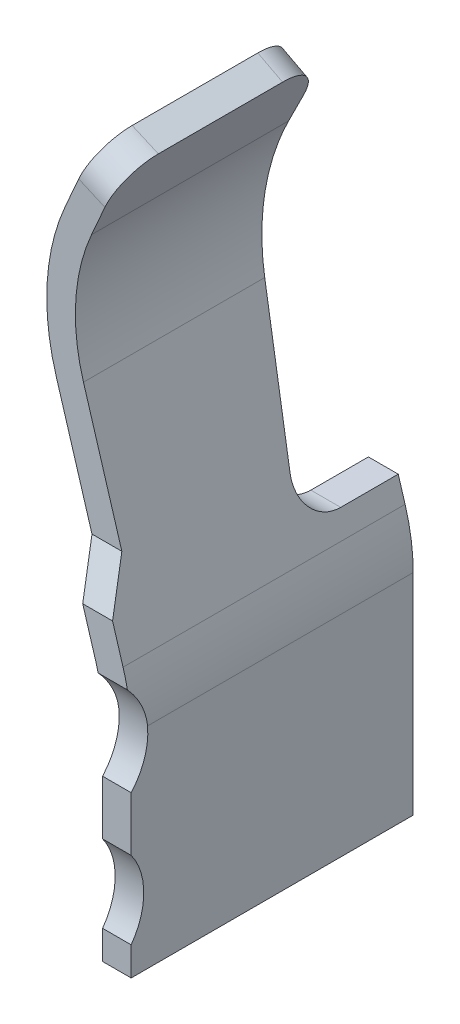
ISO-10303-21;
HEADER;
FILE_DESCRIPTION(('STEP AP214'),'2;1');
FILE_NAME('part.step','',(''),(''),'','','');
FILE_SCHEMA(('AUTOMOTIVE_DESIGN { 1 0 10303 214 1 1 1 1 }'));
ENDSEC;
DATA;
#1=APPLICATION_CONTEXT('core data for automotive mechanical design processes');
#2=APPLICATION_PROTOCOL_DEFINITION('international standard','automotive_design',2000,#1);
#3=PRODUCT_CONTEXT('',#1,'mechanical');
#4=PRODUCT('Part','Part','',(#3));
#5=PRODUCT_RELATED_PRODUCT_CATEGORY('part','',(#4));
#6=PRODUCT_DEFINITION_FORMATION('','',#4);
#7=PRODUCT_DEFINITION_CONTEXT('part definition',#1,'design');
#8=PRODUCT_DEFINITION('design','',#6,#7);
#9=PRODUCT_DEFINITION_SHAPE('','',#8);
#10=(LENGTH_UNIT() NAMED_UNIT(*) SI_UNIT(.MILLI.,.METRE.));
#11=(NAMED_UNIT(*) PLANE_ANGLE_UNIT() SI_UNIT($,.RADIAN.));
#12=(NAMED_UNIT(*) SI_UNIT($,.STERADIAN.) SOLID_ANGLE_UNIT());
#13=UNCERTAINTY_MEASURE_WITH_UNIT(LENGTH_MEASURE(1.E-05),#10,'distance_accuracy_value','');
#14=(GEOMETRIC_REPRESENTATION_CONTEXT(3) GLOBAL_UNCERTAINTY_ASSIGNED_CONTEXT((#13)) GLOBAL_UNIT_ASSIGNED_CONTEXT((#10,
#11,#12)) REPRESENTATION_CONTEXT('',''));
#15=CARTESIAN_POINT('',(0.,0.,0.));
#16=DIRECTION('',(0.,0.,1.));
#17=DIRECTION('',(1.,0.,0.));
#18=AXIS2_PLACEMENT_3D('',#15,#16,#17);
#19=CARTESIAN_POINT('',(-3.20155506681892,3.52330708865174,0.423604352914839));
#20=DIRECTION('',(0.915327071470027,-0.402711251685503,0.));
#21=DIRECTION('',(0.402711251685503,0.915327071470027,0.));
#22=AXIS2_PLACEMENT_3D('',#19,#20,#21);
#23=CYLINDRICAL_SURFACE('',#22,0.2);
#24=CARTESIAN_POINT('',(-3.20155506681891,3.52330708865174,0.423604352914839));
#25=DIRECTION('',(-0.915327071470028,0.4027112516855,0.));
#26=DIRECTION('',(0.4027112516855,0.915327071470028,0.));
#27=AXIS2_PLACEMENT_3D('',#24,#25,#26);
#28=CIRCLE('',#27,0.2);
#29=CARTESIAN_POINT('',(-3.20155506681891,3.52330708865174,0.623604352914839));
#30=VERTEX_POINT('',#29);
#31=CARTESIAN_POINT('',(-3.12101281648181,3.70637250294574,0.423604352914839));
#32=VERTEX_POINT('',#31);
#33=EDGE_CURVE('E471',#30,#32,#28,.T.);
#34=ORIENTED_EDGE('',*,*,#33,.F.);
#35=DIRECTION('',(-0.915327071470027,0.402711251685503,0.));
#36=VECTOR('',#35,1.);
#37=CARTESIAN_POINT('',(-27.8115059297134,14.3508073613119,0.623604352914805));
#38=LINE('',#37,#36);
#39=CARTESIAN_POINT('',(-3.06425600609841,3.46290040089891,0.623604352914839));
#40=VERTEX_POINT('',#39);
#41=EDGE_CURVE('E27',#40,#30,#38,.T.);
#42=ORIENTED_EDGE('',*,*,#41,.F.);
#43=CARTESIAN_POINT('',(-3.06425600609841,3.46290040089891,0.423604352914839));
#44=DIRECTION('',(0.915327071470027,-0.402711251685502,0.));
#45=DIRECTION('',(-0.402711251685502,-0.915327071470027,0.));
#46=AXIS2_PLACEMENT_3D('',#43,#44,#45);
#47=CIRCLE('',#46,0.2);
#48=CARTESIAN_POINT('',(-2.98371375576131,3.64596581519291,0.423604352914839));
#49=VERTEX_POINT('',#48);
#50=EDGE_CURVE('E567',#49,#40,#47,.T.);
#51=ORIENTED_EDGE('',*,*,#50,.F.);
#52=DIRECTION('',(0.915327071470027,-0.402711251685503,0.));
#53=VECTOR('',#52,1.);
#54=CARTESIAN_POINT('',(-3.12101281648181,3.70637250294574,0.423604352914839));
#55=LINE('',#54,#53);
#56=EDGE_CURVE('E445',#32,#49,#55,.T.);
#57=ORIENTED_EDGE('',*,*,#56,.F.);
#58=EDGE_LOOP('',(#34,#42,#51,#57));
#59=FACE_BOUND('',#58,.T.);
#60=ADVANCED_FACE('F16',(#59),#23,.T.);
#61=CARTESIAN_POINT('',(-3.22386274132999,3.53312166947706,-0.236832722369337));
#62=DIRECTION('',(-0.914255270392898,0.402239697454473,-0.0483789866630451));
#63=DIRECTION('',(-0.402711251685503,-0.915327071470027,0.));
#64=AXIS2_PLACEMENT_3D('',#61,#62,#63);
#65=CYLINDRICAL_SURFACE('',#64,0.2);
#66=CARTESIAN_POINT('',(-3.07305946195422,3.44289092405021,-0.427421697659668));
#67=CARTESIAN_POINT('',(-3.02198253480763,3.55898426375477,-0.441384710680955));
#68=CARTESIAN_POINT('',(-2.98371375576131,3.64596581519291,-0.356133634256613));
#69=CARTESIAN_POINT('',(-2.98371375576131,3.64596581519291,-0.228386927890316));
#70=(BOUNDED_CURVE() B_SPLINE_CURVE(3,(#66,#67,#68,#69),.UNSPECIFIED.,.F.,
.F.) B_SPLINE_CURVE_WITH_KNOTS((4,4),(6.17366415670651,7.85398163397443),
.UNSPECIFIED.) CURVE() GEOMETRIC_REPRESENTATION_ITEM() RATIONAL_B_SPLINE_CURVE((1.,
0.77822974253387,0.77822974253387,1.)) REPRESENTATION_ITEM(''));
#71=CARTESIAN_POINT('',(-3.07305946195422,3.44289092405021,-0.427421697659668));
#72=VERTEX_POINT('',#71);
#73=CARTESIAN_POINT('',(-2.98371375576131,3.64596581519291,-0.228386927890316));
#74=VERTEX_POINT('',#73);
#75=EDGE_CURVE('E571',#72,#74,#70,.T.);
#76=ORIENTED_EDGE('',*,*,#75,.F.);
#77=DIRECTION('',(0.914255270392898,-0.402239697454473,0.0483789866630451));
#78=VECTOR('',#77,1.);
#79=CARTESIAN_POINT('',(-28.411852655037,14.5910558161891,-1.76825633941021));
#80=LINE('',#79,#78);
#81=CARTESIAN_POINT('',(-3.21035852267473,3.50329761180303,-0.434687053017796));
#82=VERTEX_POINT('',#81);
#83=EDGE_CURVE('E11',#82,#72,#80,.T.);
#84=ORIENTED_EDGE('',*,*,#83,.F.);
#85=CARTESIAN_POINT('',(-3.12101281648181,3.70637250294574,-0.235652283248443));
#86=CARTESIAN_POINT('',(-3.12101281648182,3.70637250294574,-0.363398989614741));
#87=CARTESIAN_POINT('',(-3.15928159552814,3.6193909515076,-0.448650066039083));
#88=CARTESIAN_POINT('',(-3.21035852267473,3.50329761180303,-0.434687053017796));
#89=(BOUNDED_CURVE() B_SPLINE_CURVE(3,(#85,#86,#87,#88),.UNSPECIFIED.,.F.,
.F.) B_SPLINE_CURVE_WITH_KNOTS((4,4),(4.71238898038476,6.39270645765268),
.UNSPECIFIED.) CURVE() GEOMETRIC_REPRESENTATION_ITEM() RATIONAL_B_SPLINE_CURVE((1.,
0.77822974253387,0.77822974253387,1.)) REPRESENTATION_ITEM(''));
#90=CARTESIAN_POINT('',(-3.12101281648181,3.70637250294574,-0.235652283248443));
#91=VERTEX_POINT('',#90);
#92=EDGE_CURVE('E462',#91,#82,#89,.T.);
#93=ORIENTED_EDGE('',*,*,#92,.F.);
#94=DIRECTION('',(-0.914255270392898,0.402239697454473,-0.0483789866630451));
#95=VECTOR('',#94,1.);
#96=CARTESIAN_POINT('',(-3.14332049099289,3.71618708377106,-0.236832722369337));
#97=LINE('',#96,#95);
#98=EDGE_CURVE('E449',#74,#91,#97,.T.);
#99=ORIENTED_EDGE('',*,*,#98,.F.);
#100=EDGE_LOOP('',(#76,#84,#93,#99));
#101=FACE_BOUND('',#100,.T.);
#102=ADVANCED_FACE('F854',(#101),#65,.T.);
#103=CARTESIAN_POINT('',(-33.27,1.65634067151207,-0.212546111318104));
#104=DIRECTION('',(0.,-1.,0.));
#105=DIRECTION('',(0.,0.,-1.));
#106=AXIS2_PLACEMENT_3D('',#103,#104,#105);
#107=PLANE('',#106);
#108=DIRECTION('',(0.,0.,-1.));
#109=VECTOR('',#108,1.);
#110=CARTESIAN_POINT('',(-3.04516492105846,1.65634067151207,-0.740000000000018));
#111=LINE('',#110,#109);
#112=CARTESIAN_POINT('',(-3.04516492105846,1.65634067151207,-0.438042305987952));
#113=VERTEX_POINT('',#112);
#114=CARTESIAN_POINT('',(-3.04516492105846,1.65634067151207,-0.740000000000018));
#115=VERTEX_POINT('',#114);
#116=EDGE_CURVE('E269',#113,#115,#111,.T.);
#117=ORIENTED_EDGE('',*,*,#116,.F.);
#118=DIRECTION('',(1.,0.,0.));
#119=VECTOR('',#118,1.);
#120=CARTESIAN_POINT('',(-2.88849659089444,1.65634067151207,-0.438042305987951));
#121=LINE('',#120,#119);
#122=CARTESIAN_POINT('',(-2.88849659089442,1.65634067151207,-0.438042305987951));
#123=VERTEX_POINT('',#122);
#124=EDGE_CURVE('E231',#113,#123,#121,.T.);
#125=ORIENTED_EDGE('',*,*,#124,.T.);
#126=DIRECTION('',(0.,0.,1.));
#127=VECTOR('',#126,1.);
#128=CARTESIAN_POINT('',(-2.88849659089442,1.65634067151207,-0.740000000000018));
#129=LINE('',#128,#127);
#130=CARTESIAN_POINT('',(-2.88849659089442,1.65634067151207,-0.740000000000018));
#131=VERTEX_POINT('',#130);
#132=EDGE_CURVE('E228',#131,#123,#129,.T.);
#133=ORIENTED_EDGE('',*,*,#132,.F.);
#134=DIRECTION('',(-1.,0.,0.));
#135=VECTOR('',#134,1.);
#136=CARTESIAN_POINT('',(-3.81,1.65634067151207,-0.740000000000019));
#137=LINE('',#136,#135);
#138=EDGE_CURVE('E213',#131,#115,#137,.T.);
#139=ORIENTED_EDGE('',*,*,#138,.T.);
#140=EDGE_LOOP('',(#117,#125,#133,#139));
#141=FACE_BOUND('',#140,.T.);
#142=ADVANCED_FACE('F229',(#141),#107,.F.);
#143=CARTESIAN_POINT('',(-33.27,3.70637250294571,-0.459111687165995));
#144=DIRECTION('',(0.,0.119413416546905,0.992844618230162));
#145=DIRECTION('',(1.,0.,0.));
#146=AXIS2_PLACEMENT_3D('',#143,#144,#145);
#147=PLANE('',#146);
#148=DIRECTION('',(-0.28674853992682,0.951150986717314,-0.11439875574724));
#149=VECTOR('',#148,1.);
#150=CARTESIAN_POINT('',(-2.87033604511149,1.59610175610151,-0.205300934614502));
#151=LINE('',#150,#149);
#152=CARTESIAN_POINT('',(-2.95599169256637,1.88022335482146,-0.239473382341919));
#153=VERTEX_POINT('',#152);
#154=CARTESIAN_POINT('',(-3.17658626409634,2.61194022573825,-0.327479914176621));
#155=VERTEX_POINT('',#154);
#156=EDGE_CURVE('E235',#153,#155,#151,.T.);
#157=ORIENTED_EDGE('',*,*,#156,.F.);
#158=DIRECTION('',(-1.,0.,0.));
#159=VECTOR('',#158,1.);
#160=CARTESIAN_POINT('',(-3.04516492105847,1.88022335482146,-0.23947338234192));
#161=LINE('',#160,#159);
#162=CARTESIAN_POINT('',(-3.11266002273041,1.88022335482146,-0.23947338234192));
#163=VERTEX_POINT('',#162);
#164=EDGE_CURVE('E379',#153,#163,#161,.T.);
#165=ORIENTED_EDGE('',*,*,#164,.T.);
#166=DIRECTION('',(0.286748539926818,-0.951150986717315,0.11439875574724));
#167=VECTOR('',#166,1.);
#168=CARTESIAN_POINT('',(-3.01412236488806,1.55337185451571,-0.200161637444145));
#169=LINE('',#168,#167);
#170=CARTESIAN_POINT('',(-3.32020176045379,2.56864369924933,-0.322272466749579));
#171=VERTEX_POINT('',#170);
#172=EDGE_CURVE('E545',#171,#163,#169,.T.);
#173=ORIENTED_EDGE('',*,*,#172,.F.);
#174=CARTESIAN_POINT('',(-3.27177575390392,3.36370167510267,-0.417897288102545));
#175=CARTESIAN_POINT('',(-3.38330079490673,3.11021511680704,-0.387409439934768));
#176=CARTESIAN_POINT('',(-3.40013739459604,2.83379189253285,-0.354162906673266));
#177=CARTESIAN_POINT('',(-3.32020176045379,2.56864369924933,-0.322272466749579));
#178=(BOUNDED_CURVE() B_SPLINE_CURVE(3,(#174,#175,#176,#177),.UNSPECIFIED.,.F.,
.F.) B_SPLINE_CURVE_WITH_KNOTS((4,4),(4.29791199977039,5.00519872138853),
.UNSPECIFIED.) CURVE() GEOMETRIC_REPRESENTATION_ITEM() RATIONAL_B_SPLINE_CURVE((1.,
0.958744787021091,0.958744787021091,1.)) REPRESENTATION_ITEM(''));
#179=CARTESIAN_POINT('',(-3.27177575390392,3.36370167510267,-0.417897288102545));
#180=VERTEX_POINT('',#179);
#181=EDGE_CURVE('E550',#180,#171,#178,.T.);
#182=ORIENTED_EDGE('',*,*,#181,.F.);
#183=DIRECTION('',(-0.400292818236851,-0.909830186054405,0.109428936813832));
#184=VECTOR('',#183,1.);
#185=CARTESIAN_POINT('',(-3.25766648991178,3.39577078475993,-0.421754368938234));
#186=LINE('',#185,#184);
#187=EDGE_CURVE('E459',#82,#180,#186,.T.);
#188=ORIENTED_EDGE('',*,*,#187,.F.);
#189=ORIENTED_EDGE('',*,*,#83,.T.);
#190=DIRECTION('',(0.400292818236852,0.909830186054405,-0.109428936813832));
#191=VECTOR('',#190,1.);
#192=CARTESIAN_POINT('',(-3.12004918034407,3.33608744850051,-0.414576013974332));
#193=LINE('',#192,#191);
#194=CARTESIAN_POINT('',(-3.13447669318341,3.30329498734983,-0.410631932744417));
#195=VERTEX_POINT('',#194);
#196=EDGE_CURVE('E437',#195,#72,#193,.T.);
#197=ORIENTED_EDGE('',*,*,#196,.F.);
#198=CARTESIAN_POINT('',(-3.17658626409634,2.61194022573825,-0.327479914176621));
#199=CARTESIAN_POINT('',(-3.24609551117657,2.84250387207174,-0.355210731501565));
#200=CARTESIAN_POINT('',(-3.2314549897076,3.08287189317973,-0.384120760424611));
#201=CARTESIAN_POINT('',(-3.13447669318341,3.30329498734983,-0.410631932744417));
#202=(BOUNDED_CURVE() B_SPLINE_CURVE(3,(#198,#199,#200,#201),.UNSPECIFIED.,.F.,
.F.) B_SPLINE_CURVE_WITH_KNOTS((4,4),(1.27798658579106,1.98527330740919),
.UNSPECIFIED.) CURVE() GEOMETRIC_REPRESENTATION_ITEM() RATIONAL_B_SPLINE_CURVE((1.,
0.958744787021091,0.958744787021091,1.)) REPRESENTATION_ITEM(''));
#203=EDGE_CURVE('E251',#155,#195,#202,.T.);
#204=ORIENTED_EDGE('',*,*,#203,.F.);
#205=EDGE_LOOP('',(#157,#165,#173,#182,#188,#189,#197,#204));
#206=FACE_BOUND('',#205,.T.);
#207=ADVANCED_FACE('F301',(#206),#147,.F.);
#208=CARTESIAN_POINT('',(-33.27,1.94413292378283,0.623604352914797));
#209=DIRECTION('',(0.,0.,-1.));
#210=DIRECTION('',(0.,-1.,0.));
#211=AXIS2_PLACEMENT_3D('',#208,#209,#210);
#212=PLANE('',#211);
#213=DIRECTION('',(-0.402711251685501,-0.915327071470028,0.));
#214=VECTOR('',#213,1.);
#215=CARTESIAN_POINT('',(-3.13447669318342,3.30329498734984,0.623604352914839));
#216=LINE('',#215,#214);
#217=CARTESIAN_POINT('',(-3.13447669318341,3.30329498734984,0.623604352914839));
#218=VERTEX_POINT('',#217);
#219=EDGE_CURVE('E467',#40,#218,#216,.T.);
#220=ORIENTED_EDGE('',*,*,#219,.F.);
#221=ORIENTED_EDGE('',*,*,#41,.T.);
#222=DIRECTION('',(0.4027112516855,0.915327071470028,0.));
#223=VECTOR('',#222,1.);
#224=CARTESIAN_POINT('',(-3.27177575390392,3.36370167510267,0.623604352914839));
#225=LINE('',#224,#223);
#226=CARTESIAN_POINT('',(-3.27177575390392,3.36370167510267,0.623604352914839));
#227=VERTEX_POINT('',#226);
#228=EDGE_CURVE('E461',#227,#30,#225,.T.);
#229=ORIENTED_EDGE('',*,*,#228,.F.);
#230=CARTESIAN_POINT('',(-2.21914962171339,2.90058373566433,0.62360435291484));
#231=DIRECTION('',(0.,0.,-1.));
#232=DIRECTION('',(-1.,0.,0.));
#233=AXIS2_PLACEMENT_3D('',#230,#231,#232);
#234=CIRCLE('',#233,1.15);
#235=CARTESIAN_POINT('',(-3.32020176045379,2.56864369924933,0.623604352914839));
#236=VERTEX_POINT('',#235);
#237=EDGE_CURVE('E597',#236,#227,#234,.T.);
#238=ORIENTED_EDGE('',*,*,#237,.F.);
#239=DIRECTION('',(-0.288643509926088,0.957436642382956,0.));
#240=VECTOR('',#239,1.);
#241=CARTESIAN_POINT('',(-2.99617885397449,1.49385284836845,0.623604352914839));
#242=LINE('',#241,#240);
#243=CARTESIAN_POINT('',(-3.13192717993568,1.94413292378283,0.623604352914839));
#244=VERTEX_POINT('',#243);
#245=EDGE_CURVE('E454',#244,#236,#242,.T.);
#246=ORIENTED_EDGE('',*,*,#245,.F.);
#247=DIRECTION('',(1.,0.,0.));
#248=VECTOR('',#247,1.);
#249=CARTESIAN_POINT('',(-33.27,1.94413292378283,0.623604352914797));
#250=LINE('',#249,#248);
#251=CARTESIAN_POINT('',(-2.97525884977164,1.94413292378283,0.623604352914839));
#252=VERTEX_POINT('',#251);
#253=EDGE_CURVE('E225',#244,#252,#250,.T.);
#254=ORIENTED_EDGE('',*,*,#253,.T.);
#255=DIRECTION('',(0.28864350992609,-0.957436642382956,0.));
#256=VECTOR('',#255,1.);
#257=CARTESIAN_POINT('',(-2.85256335761705,1.53714937485737,0.623604352914839));
#258=LINE('',#257,#256);
#259=CARTESIAN_POINT('',(-3.17658626409635,2.61194022573825,0.623604352914839));
#260=VERTEX_POINT('',#259);
#261=EDGE_CURVE('E433',#260,#252,#258,.T.);
#262=ORIENTED_EDGE('',*,*,#261,.F.);
#263=CARTESIAN_POINT('',(-2.21914962171339,2.90058373566433,0.62360435291484));
#264=DIRECTION('',(0.,0.,1.));
#265=DIRECTION('',(-1.,0.,0.));
#266=AXIS2_PLACEMENT_3D('',#263,#264,#265);
#267=CIRCLE('',#266,1.);
#268=EDGE_CURVE('E243',#218,#260,#267,.T.);
#269=ORIENTED_EDGE('',*,*,#268,.F.);
#270=EDGE_LOOP('',(#220,#221,#229,#238,#246,#254,#262,#269));
#271=FACE_BOUND('',#270,.T.);
#272=ADVANCED_FACE('F304',(#271),#212,.F.);
#273=CARTESIAN_POINT('',(-33.27,1.7003498353216,0.749999999999972));
#274=DIRECTION('',(0.,-0.460287319631494,-0.887770005906065));
#275=DIRECTION('',(0.,-0.887770005906065,0.460287319631494));
#276=AXIS2_PLACEMENT_3D('',#273,#274,#275);
#277=PLANE('',#276);
#278=DIRECTION('',(-1.,0.,0.));
#279=VECTOR('',#278,1.);
#280=CARTESIAN_POINT('',(-3.81,1.7196371362757,0.739999999999981));
#281=LINE('',#280,#279);
#282=CARTESIAN_POINT('',(-2.90757891232074,1.7196371362757,0.739999999999982));
#283=VERTEX_POINT('',#282);
#284=CARTESIAN_POINT('',(-3.06424724248478,1.7196371362757,0.739999999999982));
#285=VERTEX_POINT('',#284);
#286=EDGE_CURVE('E472',#283,#285,#281,.T.);
#287=ORIENTED_EDGE('',*,*,#286,.F.);
#288=DIRECTION('',(0.258541028225372,-0.857586072334425,0.444637678635293));
#289=VECTOR('',#288,1.);
#290=CARTESIAN_POINT('',(-3.03357656169357,2.13757401070795,0.523309818502748));
#291=LINE('',#290,#289);
#292=EDGE_CURVE('E426',#252,#283,#291,.T.);
#293=ORIENTED_EDGE('',*,*,#292,.F.);
#294=ORIENTED_EDGE('',*,*,#253,.F.);
#295=DIRECTION('',(-0.258541028225371,0.857586072334425,-0.444637678635293));
#296=VECTOR('',#295,1.);
#297=CARTESIAN_POINT('',(-3.1797726380838,2.10283732290249,0.541319952677684));
#298=LINE('',#297,#296);
#299=EDGE_CURVE('E268',#285,#244,#298,.T.);
#300=ORIENTED_EDGE('',*,*,#299,.F.);
#301=EDGE_LOOP('',(#287,#293,#294,#300));
#302=FACE_BOUND('',#301,.T.);
#303=ADVANCED_FACE('F308',(#302),#277,.F.);
#304=CARTESIAN_POINT('',(-3.81,1.24850586493128,0.739999999999981));
#305=DIRECTION('',(0.,0.,-1.));
#306=DIRECTION('',(0.,-1.,0.));
#307=AXIS2_PLACEMENT_3D('',#304,#305,#306);
#308=PLANE('',#307);
#309=DIRECTION('',(0.,-1.,0.));
#310=VECTOR('',#309,1.);
#311=CARTESIAN_POINT('',(-2.81,0.145965815192914,0.739999999999982));
#312=LINE('',#311,#310);
#313=CARTESIAN_POINT('',(-2.81,0.296740599868486,0.739999999999982));
#314=VERTEX_POINT('',#313);
#315=CARTESIAN_POINT('',(-2.81,0.145965815192914,0.739999999999982));
#316=VERTEX_POINT('',#315);
#317=EDGE_CURVE('E270',#314,#316,#312,.T.);
#318=ORIENTED_EDGE('',*,*,#317,.F.);
#319=DIRECTION('',(-1.,0.,0.));
#320=VECTOR('',#319,1.);
#321=CARTESIAN_POINT('',(-33.27,0.296740599868486,0.73999999999994));
#322=LINE('',#321,#320);
#323=CARTESIAN_POINT('',(-2.96,0.296740599868486,0.739999999999982));
#324=VERTEX_POINT('',#323);
#325=EDGE_CURVE('E440',#314,#324,#322,.T.);
#326=ORIENTED_EDGE('',*,*,#325,.T.);
#327=DIRECTION('',(0.,1.,0.));
#328=VECTOR('',#327,1.);
#329=CARTESIAN_POINT('',(-2.96,0.145965815192914,0.739999999999982));
#330=LINE('',#329,#328);
#331=CARTESIAN_POINT('',(-2.96,0.145965815192914,0.739999999999982));
#332=VERTEX_POINT('',#331);
#333=EDGE_CURVE('E255',#332,#324,#330,.T.);
#334=ORIENTED_EDGE('',*,*,#333,.F.);
#335=DIRECTION('',(-1.,0.,0.));
#336=VECTOR('',#335,1.);
#337=CARTESIAN_POINT('',(-2.96,0.145965815192914,0.739999999999982));
#338=LINE('',#337,#336);
#339=EDGE_CURVE('E532',#316,#332,#338,.T.);
#340=ORIENTED_EDGE('',*,*,#339,.F.);
#341=EDGE_LOOP('',(#318,#326,#334,#340));
#342=FACE_BOUND('',#341,.T.);
#343=ADVANCED_FACE('F950',(#342),#308,.F.);
#344=CARTESIAN_POINT('',(-3.81,1.24850586493128,-0.740000000000019));
#345=DIRECTION('',(0.,0.,-1.));
#346=DIRECTION('',(0.,-1.,0.));
#347=AXIS2_PLACEMENT_3D('',#344,#345,#346);
#348=PLANE('',#347);
#349=ORIENTED_EDGE('',*,*,#138,.F.);
#350=DIRECTION('',(0.28864350992609,-0.957436642382956,0.));
#351=VECTOR('',#350,1.);
#352=CARTESIAN_POINT('',(-2.85256335761705,1.53714937485737,-0.740000000000018));
#353=LINE('',#352,#351);
#354=CARTESIAN_POINT('',(-2.85256335761705,1.53714937485737,-0.740000000000018));
#355=VERTEX_POINT('',#354);
#356=EDGE_CURVE('E217',#131,#355,#353,.T.);
#357=ORIENTED_EDGE('',*,*,#356,.T.);
#358=CARTESIAN_POINT('',(-3.81,1.24850586493128,-0.740000000000019));
#359=DIRECTION('',(0.,0.,-1.));
#360=DIRECTION('',(-1.,0.,0.));
#361=AXIS2_PLACEMENT_3D('',#358,#359,#360);
#362=CIRCLE('',#361,1.);
#363=CARTESIAN_POINT('',(-2.81,1.24850586493128,-0.740000000000018));
#364=VERTEX_POINT('',#363);
#365=EDGE_CURVE('E273',#355,#364,#362,.T.);
#366=ORIENTED_EDGE('',*,*,#365,.T.);
#367=DIRECTION('',(0.,-1.,0.));
#368=VECTOR('',#367,1.);
#369=CARTESIAN_POINT('',(-2.81,0.145965815192914,-0.740000000000018));
#370=LINE('',#369,#368);
#371=CARTESIAN_POINT('',(-2.81,0.145965815192914,-0.740000000000018));
#372=VERTEX_POINT('',#371);
#373=EDGE_CURVE('E42',#364,#372,#370,.T.);
#374=ORIENTED_EDGE('',*,*,#373,.T.);
#375=DIRECTION('',(-1.,0.,0.));
#376=VECTOR('',#375,1.);
#377=CARTESIAN_POINT('',(-2.96,0.145965815192914,-0.740000000000018));
#378=LINE('',#377,#376);
#379=CARTESIAN_POINT('',(-2.96,0.145965815192914,-0.740000000000018));
#380=VERTEX_POINT('',#379);
#381=EDGE_CURVE('E453',#372,#380,#378,.T.);
#382=ORIENTED_EDGE('',*,*,#381,.T.);
#383=DIRECTION('',(0.,1.,0.));
#384=VECTOR('',#383,1.);
#385=CARTESIAN_POINT('',(-2.96,0.145965815192914,-0.740000000000018));
#386=LINE('',#385,#384);
#387=CARTESIAN_POINT('',(-2.96,1.24850586493128,-0.740000000000018));
#388=VERTEX_POINT('',#387);
#389=EDGE_CURVE('E370',#380,#388,#386,.T.);
#390=ORIENTED_EDGE('',*,*,#389,.T.);
#391=CARTESIAN_POINT('',(-3.81,1.24850586493128,-0.740000000000019));
#392=DIRECTION('',(0.,0.,1.));
#393=DIRECTION('',(-1.,0.,0.));
#394=AXIS2_PLACEMENT_3D('',#391,#392,#393);
#395=CIRCLE('',#394,0.85);
#396=CARTESIAN_POINT('',(-2.99617885397448,1.49385284836845,-0.740000000000018));
#397=VERTEX_POINT('',#396);
#398=EDGE_CURVE('E574',#388,#397,#395,.T.);
#399=ORIENTED_EDGE('',*,*,#398,.T.);
#400=DIRECTION('',(-0.288643509926088,0.957436642382956,0.));
#401=VECTOR('',#400,1.);
#402=CARTESIAN_POINT('',(-2.99617885397448,1.49385284836845,-0.740000000000018));
#403=LINE('',#402,#401);
#404=EDGE_CURVE('E220',#397,#115,#403,.T.);
#405=ORIENTED_EDGE('',*,*,#404,.T.);
#406=EDGE_LOOP('',(#349,#357,#366,#374,#382,#390,#399,#405));
#407=FACE_BOUND('',#406,.T.);
#408=ADVANCED_FACE('F215',(#407),#348,.T.);
#409=CARTESIAN_POINT('',(-2.81,0.145965815192914,-0.740000000000018));
#410=DIRECTION('',(-1.,0.,0.));
#411=DIRECTION('',(0.,0.,1.));
#412=AXIS2_PLACEMENT_3D('',#409,#410,#411);
#413=PLANE('',#412);
#414=DIRECTION('',(0.,0.,1.));
#415=VECTOR('',#414,1.);
#416=CARTESIAN_POINT('',(-2.81,1.24850586493128,-0.740000000000018));
#417=LINE('',#416,#415);
#418=CARTESIAN_POINT('',(-2.81,1.24850586493128,0.654029100989327));
#419=VERTEX_POINT('',#418);
#420=EDGE_CURVE('E416',#364,#419,#417,.T.);
#421=ORIENTED_EDGE('',*,*,#420,.T.);
#422=CARTESIAN_POINT('',(-2.81,1.21669179396546,0.995153761033099));
#423=DIRECTION('',(1.,0.,0.));
#424=DIRECTION('',(0.,0.,1.));
#425=AXIS2_PLACEMENT_3D('',#422,#423,#424);
#426=CIRCLE('',#425,0.342604974863759);
#427=CARTESIAN_POINT('',(-2.81,0.988055123608201,0.739999999999982));
#428=VERTEX_POINT('',#427);
#429=EDGE_CURVE('E400',#428,#419,#426,.T.);
#430=ORIENTED_EDGE('',*,*,#429,.F.);
#431=DIRECTION('',(0.,-1.,0.));
#432=VECTOR('',#431,1.);
#433=CARTESIAN_POINT('',(-2.81,0.145965815192914,0.739999999999982));
#434=LINE('',#433,#432);
#435=CARTESIAN_POINT('',(-2.81,0.703259400131467,0.739999999999982));
#436=VERTEX_POINT('',#435);
#437=EDGE_CURVE('E587',#428,#436,#434,.T.);
#438=ORIENTED_EDGE('',*,*,#437,.T.);
#439=CARTESIAN_POINT('',(-2.81,0.499999999999977,1.01942683457021));
#440=DIRECTION('',(1.,0.,0.));
#441=DIRECTION('',(0.,0.,1.));
#442=AXIS2_PLACEMENT_3D('',#439,#440,#441);
#443=CIRCLE('',#442,0.345533991988848);
#444=EDGE_CURVE('E444',#314,#436,#443,.T.);
#445=ORIENTED_EDGE('',*,*,#444,.F.);
#446=ORIENTED_EDGE('',*,*,#317,.T.);
#447=DIRECTION('',(0.,0.,1.));
#448=VECTOR('',#447,1.);
#449=CARTESIAN_POINT('',(-2.81,0.145965815192914,-0.740000000000018));
#450=LINE('',#449,#448);
#451=EDGE_CURVE('E371',#372,#316,#450,.T.);
#452=ORIENTED_EDGE('',*,*,#451,.F.);
#453=ORIENTED_EDGE('',*,*,#373,.F.);
#454=EDGE_LOOP('',(#421,#430,#438,#445,#446,#452,#453));
#455=FACE_BOUND('',#454,.T.);
#456=ADVANCED_FACE('F319',(#455),#413,.F.);
#457=CARTESIAN_POINT('',(-3.81,1.24850586493128,-0.740000000000019));
#458=DIRECTION('',(0.,0.,1.));
#459=DIRECTION('',(1.,0.,0.));
#460=AXIS2_PLACEMENT_3D('',#457,#458,#459);
#461=CYLINDRICAL_SURFACE('',#460,1.);
#462=CARTESIAN_POINT('',(-3.81,1.24850586493128,0.739999999999981));
#463=DIRECTION('',(0.,0.,-1.));
#464=DIRECTION('',(-1.,0.,0.));
#465=AXIS2_PLACEMENT_3D('',#462,#463,#464);
#466=CIRCLE('',#465,1.);
#467=CARTESIAN_POINT('',(-2.85256335761705,1.53714937485737,0.739999999999982));
#468=VERTEX_POINT('',#467);
#469=CARTESIAN_POINT('',(-2.82956088186527,1.44532846432271,0.739999999999982));
#470=VERTEX_POINT('',#469);
#471=EDGE_CURVE('E343',#468,#470,#466,.T.);
#472=ORIENTED_EDGE('',*,*,#471,.T.);
#473=CARTESIAN_POINT('',(-2.82956088186528,1.44532846432271,0.739999999999982));
#474=CARTESIAN_POINT('',(-2.82887868258316,1.44193024717417,0.736954698545497));
#475=CARTESIAN_POINT('',(-2.82820278149149,1.43847176034264,0.733975045899673));
#476=CARTESIAN_POINT('',(-2.826871440474,1.43145643098159,0.728168909339876));
#477=CARTESIAN_POINT('',(-2.82621591068375,1.42790021102154,0.725341693611786));
#478=CARTESIAN_POINT('',(-2.82492831183025,1.42068928784943,0.719840380711082));
#479=CARTESIAN_POINT('',(-2.82429616172075,1.41703501951577,0.71716573280542));
#480=CARTESIAN_POINT('',(-2.8230584278734,1.40962817005605,0.711969336935208));
#481=CARTESIAN_POINT('',(-2.82245278447869,1.40587584366106,0.709447240161664));
#482=CARTESIAN_POINT('',(-2.82127122870312,1.39827302810691,0.704555749407203));
#483=CARTESIAN_POINT('',(-2.82069529111151,1.3944226264712,0.702186225501798));
#484=CARTESIAN_POINT('',(-2.819576382774,1.38662388081493,0.697599649617223));
#485=CARTESIAN_POINT('',(-2.8190334341832,1.38267547342748,0.695382699975703));
#486=CARTESIAN_POINT('',(-2.81798380395004,1.37468096295891,0.691101059928101));
#487=CARTESIAN_POINT('',(-2.81747720426113,1.37063466501766,0.689036713287234));
#488=CARTESIAN_POINT('',(-2.81650364840602,1.36244473872734,0.685059955148872));
#489=CARTESIAN_POINT('',(-2.81603684560395,1.35830080604148,0.683148133100298));
#490=CARTESIAN_POINT('',(-2.81514614898274,1.34991442649087,0.679475891500459));
#491=CARTESIAN_POINT('',(-2.81472250492899,1.34567156354324,0.677716361222166));
#492=CARTESIAN_POINT('',(-2.81392647194206,1.33713872195216,0.674376033868776));
#493=CARTESIAN_POINT('',(-2.81355381064897,1.33284913740271,0.672794295796527));
#494=CARTESIAN_POINT('',(-2.81286136145208,1.32422362544486,0.669809238507249));
#495=CARTESIAN_POINT('',(-2.81254136585005,1.31988795555424,0.668405223722618));
#496=CARTESIAN_POINT('',(-2.81195585588988,1.3111710125325,0.665775382478355));
#497=CARTESIAN_POINT('',(-2.81169020857531,1.30678987892384,0.664549123358638));
#498=CARTESIAN_POINT('',(-2.81121500632154,1.29798278695399,0.662274523841769));
#499=CARTESIAN_POINT('',(-2.81100540203927,1.29355687160846,0.661226027233375));
#500=CARTESIAN_POINT('',(-2.81064388775924,1.28466100981375,0.659306657193404));
#501=CARTESIAN_POINT('',(-2.81049201945118,1.28019103392983,0.65843591232121));
#502=CARTESIAN_POINT('',(-2.81024760848128,1.27120787033427,0.656871822149784));
#503=CARTESIAN_POINT('',(-2.81015520429872,1.26669460642052,0.65617889318396));
#504=CARTESIAN_POINT('',(-2.81003124362393,1.25762568522579,0.654969909316688));
#505=CARTESIAN_POINT('',(-2.80999992587799,1.25306993125335,0.654454554866671));
#506=CARTESIAN_POINT('',(-2.81,1.24850586493128,0.654029100989326));
#507=B_SPLINE_CURVE_WITH_KNOTS('',3,(#473,#474,#475,#476,#477,#478,#479,#480,#481,#482,#483,
#484,#485,#486,#487,#488,#489,#490,#491,#492,#493,#494,#495,#496,#497,#498,#499,#500,#501,#502,
#503,#504,#505,#506),.UNSPECIFIED.,.F.,.F.,(4,2,2,2,2,2,2,2,2,2,2,2,2,2,2,2,4),(0.,
0.013840721206231,0.0276076629971236,0.0413212735161823,0.0550022400254227,0.0686713979831094,
0.0823496367920793,0.0960578043229842,0.109816612381107,0.123650992269108,0.137408310969834,
0.151110002599701,0.164777762982982,0.178433449670465,0.192098978145581,0.205796216649571,
0.219546882133365),.UNSPECIFIED.);
#508=EDGE_CURVE('E338',#470,#419,#507,.T.);
#509=ORIENTED_EDGE('',*,*,#508,.T.);
#510=ORIENTED_EDGE('',*,*,#420,.F.);
#511=ORIENTED_EDGE('',*,*,#365,.F.);
#512=DIRECTION('',(0.,0.,1.));
#513=VECTOR('',#512,1.);
#514=CARTESIAN_POINT('',(-2.85256335761705,1.53714937485737,-0.740000000000018));
#515=LINE('',#514,#513);
#516=EDGE_CURVE('E241',#355,#468,#515,.T.);
#517=ORIENTED_EDGE('',*,*,#516,.T.);
#518=EDGE_LOOP('',(#472,#509,#510,#511,#517));
#519=FACE_BOUND('',#518,.T.);
#520=ADVANCED_FACE('F316',(#519),#461,.T.);
#521=CARTESIAN_POINT('',(-2.85256335761705,1.53714937485737,-0.740000000000018));
#522=DIRECTION('',(-0.957436642382956,-0.28864350992609,0.));
#523=DIRECTION('',(-0.28864350992609,0.957436642382956,0.));
#524=AXIS2_PLACEMENT_3D('',#521,#522,#523);
#525=PLANE('',#524);
#526=ORIENTED_EDGE('',*,*,#356,.F.);
#527=ORIENTED_EDGE('',*,*,#132,.T.);
#528=CARTESIAN_POINT('',(-2.88849659089442,1.65634067151207,-0.438042305987951));
#529=CARTESIAN_POINT('',(-2.88849659089442,1.65634067151208,-0.320885018462571));
#530=CARTESIAN_POINT('',(-2.91347162343648,1.73918338398669,-0.238042305987951));
#531=CARTESIAN_POINT('',(-2.94879165317817,1.85634067151208,-0.238042305987952));
#532=(BOUNDED_CURVE() B_SPLINE_CURVE(3,(#528,#529,#530,#531),.UNSPECIFIED.,.F.,
.F.) B_SPLINE_CURVE_WITH_KNOTS((4,4),(3.1415926535898,4.71238898038469),
.UNSPECIFIED.) CURVE() GEOMETRIC_REPRESENTATION_ITEM() RATIONAL_B_SPLINE_CURVE((1.,
0.804737854124365,0.804737854124365,1.)) REPRESENTATION_ITEM(''));
#533=CARTESIAN_POINT('',(-2.94879165317817,1.85634067151208,-0.238042305987952));
#534=VERTEX_POINT('',#533);
#535=EDGE_CURVE('E257',#123,#534,#532,.T.);
#536=ORIENTED_EDGE('',*,*,#535,.T.);
#537=CARTESIAN_POINT('',(-2.94879165317817,1.85634067151208,-0.238042305987952));
#538=CARTESIAN_POINT('',(-2.95119884441548,1.86432537588468,-0.238042305987952));
#539=CARTESIAN_POINT('',(-2.95360172570135,1.87229578405696,-0.23851990151267));
#540=CARTESIAN_POINT('',(-2.95599169256637,1.88022335482146,-0.239473382341919));
#541=(BOUNDED_CURVE() B_SPLINE_CURVE(3,(#537,#538,#539,#540),.UNSPECIFIED.,.F.,
.F.) B_SPLINE_CURVE_WITH_KNOTS((4,4),(4.71238898038469,4.83208803082147),
.UNSPECIFIED.) CURVE() GEOMETRIC_REPRESENTATION_ITEM() RATIONAL_B_SPLINE_CURVE((1.,
0.998806367803328,0.998806367803328,1.)) REPRESENTATION_ITEM(''));
#542=EDGE_CURVE('E262',#534,#153,#541,.T.);
#543=ORIENTED_EDGE('',*,*,#542,.T.);
#544=ORIENTED_EDGE('',*,*,#156,.T.);
#545=DIRECTION('',(0.,0.,1.));
#546=VECTOR('',#545,1.);
#547=CARTESIAN_POINT('',(-3.17658626409634,2.61194022573825,-0.740000000000018));
#548=LINE('',#547,#546);
#549=EDGE_CURVE('E466',#155,#260,#548,.T.);
#550=ORIENTED_EDGE('',*,*,#549,.T.);
#551=ORIENTED_EDGE('',*,*,#261,.T.);
#552=ORIENTED_EDGE('',*,*,#292,.T.);
#553=DIRECTION('',(0.28864350992609,-0.957436642382956,0.));
#554=VECTOR('',#553,1.);
#555=CARTESIAN_POINT('',(-2.85256335761705,1.53714937485737,0.739999999999982));
#556=LINE('',#555,#554);
#557=EDGE_CURVE('E475',#283,#468,#556,.T.);
#558=ORIENTED_EDGE('',*,*,#557,.T.);
#559=ORIENTED_EDGE('',*,*,#516,.F.);
#560=EDGE_LOOP('',(#526,#527,#536,#543,#544,#550,#551,#552,#558,#559));
#561=FACE_BOUND('',#560,.T.);
#562=ADVANCED_FACE('F238',(#561),#525,.F.);
#563=CARTESIAN_POINT('',(-2.21914962171339,2.90058373566433,-0.740000000000017));
#564=DIRECTION('',(0.,0.,1.));
#565=DIRECTION('',(1.,0.,0.));
#566=AXIS2_PLACEMENT_3D('',#563,#564,#565);
#567=CYLINDRICAL_SURFACE('',#566,1.);
#568=ORIENTED_EDGE('',*,*,#549,.F.);
#569=ORIENTED_EDGE('',*,*,#203,.T.);
#570=DIRECTION('',(0.,0.,1.));
#571=VECTOR('',#570,1.);
#572=CARTESIAN_POINT('',(-3.13447669318341,3.30329498734983,-0.740000000000018));
#573=LINE('',#572,#571);
#574=EDGE_CURVE('E463',#195,#218,#573,.T.);
#575=ORIENTED_EDGE('',*,*,#574,.T.);
#576=ORIENTED_EDGE('',*,*,#268,.T.);
#577=EDGE_LOOP('',(#568,#569,#575,#576));
#578=FACE_BOUND('',#577,.T.);
#579=ADVANCED_FACE('F840',(#578),#567,.F.);
#580=CARTESIAN_POINT('',(-3.13447669318341,3.30329498734984,-0.740000000000018));
#581=DIRECTION('',(-0.915327071470028,0.402711251685501,0.));
#582=DIRECTION('',(0.,0.,1.));
#583=AXIS2_PLACEMENT_3D('',#580,#581,#582);
#584=PLANE('',#583);
#585=ORIENTED_EDGE('',*,*,#196,.T.);
#586=ORIENTED_EDGE('',*,*,#75,.T.);
#587=DIRECTION('',(0.,0.,1.));
#588=VECTOR('',#587,1.);
#589=CARTESIAN_POINT('',(-2.98371375576131,3.64596581519291,-0.740000000000018));
#590=LINE('',#589,#588);
#591=EDGE_CURVE('E468',#74,#49,#590,.T.);
#592=ORIENTED_EDGE('',*,*,#591,.T.);
#593=ORIENTED_EDGE('',*,*,#50,.T.);
#594=ORIENTED_EDGE('',*,*,#219,.T.);
#595=ORIENTED_EDGE('',*,*,#574,.F.);
#596=EDGE_LOOP('',(#585,#586,#592,#593,#594,#595));
#597=FACE_BOUND('',#596,.T.);
#598=ADVANCED_FACE('F843',(#597),#584,.F.);
#599=CARTESIAN_POINT('',(-3.12101281648181,3.70637250294574,-0.740000000000018));
#600=DIRECTION('',(-0.402711251685503,-0.915327071470027,0.));
#601=DIRECTION('',(-0.915327071470027,0.402711251685503,0.));
#602=AXIS2_PLACEMENT_3D('',#599,#600,#601);
#603=PLANE('',#602);
#604=ORIENTED_EDGE('',*,*,#591,.F.);
#605=ORIENTED_EDGE('',*,*,#98,.T.);
#606=DIRECTION('',(0.,0.,1.));
#607=VECTOR('',#606,1.);
#608=CARTESIAN_POINT('',(-3.12101281648181,3.70637250294574,-0.740000000000018));
#609=LINE('',#608,#607);
#610=EDGE_CURVE('E606',#91,#32,#609,.T.);
#611=ORIENTED_EDGE('',*,*,#610,.T.);
#612=ORIENTED_EDGE('',*,*,#56,.T.);
#613=EDGE_LOOP('',(#604,#605,#611,#612));
#614=FACE_BOUND('',#613,.T.);
#615=ADVANCED_FACE('F847',(#614),#603,.F.);
#616=CARTESIAN_POINT('',(-3.27177575390392,3.36370167510267,-0.740000000000018));
#617=DIRECTION('',(0.915327071470028,-0.4027112516855,0.));
#618=DIRECTION('',(0.,0.,-1.));
#619=AXIS2_PLACEMENT_3D('',#616,#617,#618);
#620=PLANE('',#619);
#621=ORIENTED_EDGE('',*,*,#610,.F.);
#622=ORIENTED_EDGE('',*,*,#92,.T.);
#623=ORIENTED_EDGE('',*,*,#187,.T.);
#624=DIRECTION('',(0.,0.,1.));
#625=VECTOR('',#624,1.);
#626=CARTESIAN_POINT('',(-3.27177575390392,3.36370167510267,-0.740000000000018));
#627=LINE('',#626,#625);
#628=EDGE_CURVE('E547',#180,#227,#627,.T.);
#629=ORIENTED_EDGE('',*,*,#628,.T.);
#630=ORIENTED_EDGE('',*,*,#228,.T.);
#631=ORIENTED_EDGE('',*,*,#33,.T.);
#632=EDGE_LOOP('',(#621,#622,#623,#629,#630,#631));
#633=FACE_BOUND('',#632,.T.);
#634=ADVANCED_FACE('F18',(#633),#620,.F.);
#635=CARTESIAN_POINT('',(-2.21914962171339,2.90058373566433,-0.740000000000017));
#636=DIRECTION('',(0.,0.,1.));
#637=DIRECTION('',(1.,0.,0.));
#638=AXIS2_PLACEMENT_3D('',#635,#636,#637);
#639=CYLINDRICAL_SURFACE('',#638,1.15);
#640=ORIENTED_EDGE('',*,*,#628,.F.);
#641=ORIENTED_EDGE('',*,*,#181,.T.);
#642=DIRECTION('',(0.,0.,1.));
#643=VECTOR('',#642,1.);
#644=CARTESIAN_POINT('',(-3.32020176045379,2.56864369924933,-0.740000000000019));
#645=LINE('',#644,#643);
#646=EDGE_CURVE('E458',#171,#236,#645,.T.);
#647=ORIENTED_EDGE('',*,*,#646,.T.);
#648=ORIENTED_EDGE('',*,*,#237,.T.);
#649=EDGE_LOOP('',(#640,#641,#647,#648));
#650=FACE_BOUND('',#649,.T.);
#651=ADVANCED_FACE('F321',(#650),#639,.T.);
#652=CARTESIAN_POINT('',(-2.99617885397448,1.49385284836845,-0.740000000000018));
#653=DIRECTION('',(0.957436642382956,0.288643509926088,0.));
#654=DIRECTION('',(0.,0.,-1.));
#655=AXIS2_PLACEMENT_3D('',#652,#653,#654);
#656=PLANE('',#655);
#657=ORIENTED_EDGE('',*,*,#172,.T.);
#658=CARTESIAN_POINT('',(-3.11266002273041,1.88022335482146,-0.23947338234192));
#659=CARTESIAN_POINT('',(-3.11027005586539,1.87229578405696,-0.23851990151267));
#660=CARTESIAN_POINT('',(-3.10786717457952,1.86432537588468,-0.238042305987952));
#661=CARTESIAN_POINT('',(-3.1054599833422,1.85634067151208,-0.238042305987952));
#662=(BOUNDED_CURVE() B_SPLINE_CURVE(3,(#658,#659,#660,#661),.UNSPECIFIED.,.F.,
.F.) B_SPLINE_CURVE_WITH_KNOTS((4,4),(1.45109727635811,1.5707963267949),
.UNSPECIFIED.) CURVE() GEOMETRIC_REPRESENTATION_ITEM() RATIONAL_B_SPLINE_CURVE((1.,
0.998806367803328,0.998806367803328,1.)) REPRESENTATION_ITEM(''));
#663=CARTESIAN_POINT('',(-3.1054599833422,1.85634067151208,-0.238042305987952));
#664=VERTEX_POINT('',#663);
#665=EDGE_CURVE('E506',#163,#664,#662,.T.);
#666=ORIENTED_EDGE('',*,*,#665,.T.);
#667=CARTESIAN_POINT('',(-3.1054599833422,1.85634067151208,-0.238042305987952));
#668=CARTESIAN_POINT('',(-3.07013995360051,1.73918338398669,-0.238042305987952));
#669=CARTESIAN_POINT('',(-3.04516492105846,1.65634067151208,-0.320885018462571));
#670=CARTESIAN_POINT('',(-3.04516492105846,1.65634067151207,-0.438042305987952));
#671=(BOUNDED_CURVE() B_SPLINE_CURVE(3,(#667,#668,#669,#670),.UNSPECIFIED.,.F.,
.F.) B_SPLINE_CURVE_WITH_KNOTS((4,4),(1.5707963267949,3.1415926535898),
.UNSPECIFIED.) CURVE() GEOMETRIC_REPRESENTATION_ITEM() RATIONAL_B_SPLINE_CURVE((1.,
0.804737854124365,0.804737854124365,1.)) REPRESENTATION_ITEM(''));
#672=EDGE_CURVE('E501',#664,#113,#671,.T.);
#673=ORIENTED_EDGE('',*,*,#672,.T.);
#674=ORIENTED_EDGE('',*,*,#116,.T.);
#675=ORIENTED_EDGE('',*,*,#404,.F.);
#676=DIRECTION('',(0.,0.,1.));
#677=VECTOR('',#676,1.);
#678=CARTESIAN_POINT('',(-2.99617885397448,1.49385284836845,-0.740000000000018));
#679=LINE('',#678,#677);
#680=CARTESIAN_POINT('',(-2.99617885397449,1.49385284836845,0.739999999999982));
#681=VERTEX_POINT('',#680);
#682=EDGE_CURVE('E582',#397,#681,#679,.T.);
#683=ORIENTED_EDGE('',*,*,#682,.T.);
#684=DIRECTION('',(-0.288643509926088,0.957436642382956,0.));
#685=VECTOR('',#684,1.);
#686=CARTESIAN_POINT('',(-2.99617885397449,1.49385284836845,0.739999999999982));
#687=LINE('',#686,#685);
#688=EDGE_CURVE('E385',#681,#285,#687,.T.);
#689=ORIENTED_EDGE('',*,*,#688,.T.);
#690=ORIENTED_EDGE('',*,*,#299,.T.);
#691=ORIENTED_EDGE('',*,*,#245,.T.);
#692=ORIENTED_EDGE('',*,*,#646,.F.);
#693=EDGE_LOOP('',(#657,#666,#673,#674,#675,#683,#689,#690,#691,#692));
#694=FACE_BOUND('',#693,.T.);
#695=ADVANCED_FACE('F299',(#694),#656,.F.);
#696=CARTESIAN_POINT('',(-3.81,1.24850586493128,-0.740000000000019));
#697=DIRECTION('',(0.,0.,1.));
#698=DIRECTION('',(1.,0.,0.));
#699=AXIS2_PLACEMENT_3D('',#696,#697,#698);
#700=CYLINDRICAL_SURFACE('',#699,0.85);
#701=DIRECTION('',(0.,0.,1.));
#702=VECTOR('',#701,1.);
#703=CARTESIAN_POINT('',(-2.96,1.24850586493128,-0.740000000000018));
#704=LINE('',#703,#702);
#705=CARTESIAN_POINT('',(-2.96,1.24850586493128,0.654029100989327));
#706=VERTEX_POINT('',#705);
#707=EDGE_CURVE('E362',#388,#706,#704,.T.);
#708=ORIENTED_EDGE('',*,*,#707,.T.);
#709=CARTESIAN_POINT('',(-2.96,1.24850586493128,0.654029100989326));
#710=CARTESIAN_POINT('',(-2.95999991209808,1.25307172693067,0.654454720262649));
#711=CARTESIAN_POINT('',(-2.96003678605821,1.25762924392979,0.654970441218028));
#712=CARTESIAN_POINT('',(-2.96018276310792,1.26670316475255,0.656180580970959));
#713=CARTESIAN_POINT('',(-2.96029161428367,1.27121965647091,0.656874371378042));
#714=CARTESIAN_POINT('',(-2.96057959660211,1.28021043459179,0.658440607166896));
#715=CARTESIAN_POINT('',(-2.96075859333338,1.28468478505201,0.659312709351935));
#716=CARTESIAN_POINT('',(-2.96118479027865,1.29359026706935,0.661235215653678));
#717=CARTESIAN_POINT('',(-2.96143196922437,1.29802141165828,0.66228556413024));
#718=CARTESIAN_POINT('',(-2.96199249708054,1.3068395578978,0.664564290110304));
#719=CARTESIAN_POINT('',(-2.96230593089033,1.31122649527135,0.665792895393359));
#720=CARTESIAN_POINT('',(-2.96299693645543,1.31995538303798,0.668427852265579));
#721=CARTESIAN_POINT('',(-2.96337469034794,1.3242971674594,0.669834705627379));
#722=CARTESIAN_POINT('',(-2.96419232362277,1.33293499859295,0.672825870710028));
#723=CARTESIAN_POINT('',(-2.96463247178105,1.33723075608409,0.674410943694401));
#724=CARTESIAN_POINT('',(-2.96557288956929,1.34577581205583,0.677758358644035));
#725=CARTESIAN_POINT('',(-2.96607350264202,1.35002467970643,0.679521703002878));
#726=CARTESIAN_POINT('',(-2.96712469332698,1.3584100270012,0.683196490683952));
#727=CARTESIAN_POINT('',(-2.96767483337838,1.36254713822215,0.685106618702925));
#728=CARTESIAN_POINT('',(-2.96882244078363,1.37072413591787,0.689079813923213));
#729=CARTESIAN_POINT('',(-2.96941975265846,1.37476428891431,0.691142377362175));
#730=CARTESIAN_POINT('',(-2.97065765882713,1.38274714659961,0.695420264462087));
#731=CARTESIAN_POINT('',(-2.97129817809436,1.3866900047576,0.697635323456153));
#732=CARTESIAN_POINT('',(-2.97261856552594,1.39447822720198,0.702217943436157));
#733=CARTESIAN_POINT('',(-2.97329842572065,1.39832361100923,0.704585473545538));
#734=CARTESIAN_POINT('',(-2.97469366221947,1.40591692940919,0.709472808735753));
#735=CARTESIAN_POINT('',(-2.97540908334705,1.40966473145107,0.7119928069134));
#736=CARTESIAN_POINT('',(-2.97687171890923,1.41706305442155,0.71718484719857));
#737=CARTESIAN_POINT('',(-2.97761901622161,1.42071327585316,0.719857292618993));
#738=CARTESIAN_POINT('',(-2.97914177726436,1.42791663066826,0.725354048734527));
#739=CARTESIAN_POINT('',(-2.97991734709405,1.43146928614062,0.728178955935433));
#740=CARTESIAN_POINT('',(-2.98149317809703,1.43847803402674,0.733980340906962));
#741=CARTESIAN_POINT('',(-2.98229355440363,1.44193346413615,0.736957587769692));
#742=CARTESIAN_POINT('',(-2.9831016601971,1.44532846432271,0.739999999999982));
#743=B_SPLINE_CURVE_WITH_KNOTS('',3,(#709,#710,#711,#712,#713,#714,#715,#716,#717,#718,#719,
#720,#721,#722,#723,#724,#725,#726,#727,#728,#729,#730,#731,#732,#733,#734,#735,#736,#737,#738,
#739,#740,#741,#742),.UNSPECIFIED.,.F.,.F.,(4,2,2,2,2,2,2,2,2,2,2,2,2,2,2,2,4),(0.,
0.0137560099806872,0.0274641281894113,0.0411461066330809,0.0548238220336385,0.0685191715444916,
0.0822539679802981,0.0960498370492121,0.109928118966896,0.123693986122853,0.137416236293067,
0.151115243354275,0.164811484933277,0.178525451068184,0.192277552593367,0.206088031282528,
0.219976873694124),.UNSPECIFIED.);
#744=CARTESIAN_POINT('',(-2.9831016601971,1.44532846432271,0.739999999999982));
#745=VERTEX_POINT('',#744);
#746=EDGE_CURVE('E281',#706,#745,#743,.T.);
#747=ORIENTED_EDGE('',*,*,#746,.T.);
#748=CARTESIAN_POINT('',(-3.81,1.24850586493128,0.739999999999981));
#749=DIRECTION('',(0.,0.,1.));
#750=DIRECTION('',(-1.,0.,0.));
#751=AXIS2_PLACEMENT_3D('',#748,#749,#750);
#752=CIRCLE('',#751,0.85);
#753=EDGE_CURVE('E382',#745,#681,#752,.T.);
#754=ORIENTED_EDGE('',*,*,#753,.T.);
#755=ORIENTED_EDGE('',*,*,#682,.F.);
#756=ORIENTED_EDGE('',*,*,#398,.F.);
#757=EDGE_LOOP('',(#708,#747,#754,#755,#756));
#758=FACE_BOUND('',#757,.T.);
#759=ADVANCED_FACE('F288',(#758),#700,.F.);
#760=CARTESIAN_POINT('',(-2.96,0.145965815192914,-0.740000000000018));
#761=DIRECTION('',(1.,0.,0.));
#762=DIRECTION('',(0.,0.,1.));
#763=AXIS2_PLACEMENT_3D('',#760,#761,#762);
#764=PLANE('',#763);
#765=DIRECTION('',(0.,1.,0.));
#766=VECTOR('',#765,1.);
#767=CARTESIAN_POINT('',(-2.96,0.145965815192914,0.739999999999982));
#768=LINE('',#767,#766);
#769=CARTESIAN_POINT('',(-2.96,0.703259400131467,0.739999999999982));
#770=VERTEX_POINT('',#769);
#771=CARTESIAN_POINT('',(-2.96,0.988055123608201,0.739999999999982));
#772=VERTEX_POINT('',#771);
#773=EDGE_CURVE('E541',#770,#772,#768,.T.);
#774=ORIENTED_EDGE('',*,*,#773,.T.);
#775=CARTESIAN_POINT('',(-2.96,1.21669179396546,0.995153761033099));
#776=DIRECTION('',(1.,0.,0.));
#777=DIRECTION('',(0.,0.,-1.));
#778=AXIS2_PLACEMENT_3D('',#775,#776,#777);
#779=CIRCLE('',#778,0.342604974863759);
#780=EDGE_CURVE('E374',#772,#706,#779,.T.);
#781=ORIENTED_EDGE('',*,*,#780,.T.);
#782=ORIENTED_EDGE('',*,*,#707,.F.);
#783=ORIENTED_EDGE('',*,*,#389,.F.);
#784=DIRECTION('',(0.,0.,1.));
#785=VECTOR('',#784,1.);
#786=CARTESIAN_POINT('',(-2.96,0.145965815192914,-0.740000000000018));
#787=LINE('',#786,#785);
#788=EDGE_CURVE('E528',#380,#332,#787,.T.);
#789=ORIENTED_EDGE('',*,*,#788,.T.);
#790=ORIENTED_EDGE('',*,*,#333,.T.);
#791=CARTESIAN_POINT('',(-2.96,0.499999999999977,1.01942683457021));
#792=DIRECTION('',(1.,0.,0.));
#793=DIRECTION('',(0.,0.,-1.));
#794=AXIS2_PLACEMENT_3D('',#791,#792,#793);
#795=CIRCLE('',#794,0.345533991988848);
#796=EDGE_CURVE('E399',#324,#770,#795,.T.);
#797=ORIENTED_EDGE('',*,*,#796,.T.);
#798=EDGE_LOOP('',(#774,#781,#782,#783,#789,#790,#797));
#799=FACE_BOUND('',#798,.T.);
#800=ADVANCED_FACE('F298',(#799),#764,.F.);
#801=CARTESIAN_POINT('',(-2.96,0.145965815192914,-0.740000000000018));
#802=DIRECTION('',(0.,1.,0.));
#803=DIRECTION('',(1.,0.,0.));
#804=AXIS2_PLACEMENT_3D('',#801,#802,#803);
#805=PLANE('',#804);
#806=ORIENTED_EDGE('',*,*,#339,.T.);
#807=ORIENTED_EDGE('',*,*,#788,.F.);
#808=ORIENTED_EDGE('',*,*,#381,.F.);
#809=ORIENTED_EDGE('',*,*,#451,.T.);
#810=EDGE_LOOP('',(#806,#807,#808,#809));
#811=FACE_BOUND('',#810,.T.);
#812=ADVANCED_FACE('F355',(#811),#805,.F.);
#813=CARTESIAN_POINT('',(-3.81,1.24850586493128,0.739999999999981));
#814=DIRECTION('',(0.,0.,-1.));
#815=DIRECTION('',(0.,-1.,0.));
#816=AXIS2_PLACEMENT_3D('',#813,#814,#815);
#817=PLANE('',#816);
#818=ORIENTED_EDGE('',*,*,#437,.F.);
#819=DIRECTION('',(-1.,0.,0.));
#820=VECTOR('',#819,1.);
#821=CARTESIAN_POINT('',(-33.27,0.988055123608201,0.73999999999994));
#822=LINE('',#821,#820);
#823=EDGE_CURVE('E378',#428,#772,#822,.T.);
#824=ORIENTED_EDGE('',*,*,#823,.T.);
#825=ORIENTED_EDGE('',*,*,#773,.F.);
#826=DIRECTION('',(1.,0.,0.));
#827=VECTOR('',#826,1.);
#828=CARTESIAN_POINT('',(-33.27,0.703259400131467,0.73999999999994));
#829=LINE('',#828,#827);
#830=EDGE_CURVE('E485',#770,#436,#829,.T.);
#831=ORIENTED_EDGE('',*,*,#830,.T.);
#832=EDGE_LOOP('',(#818,#824,#825,#831));
#833=FACE_BOUND('',#832,.T.);
#834=ADVANCED_FACE('F929',(#833),#817,.F.);
#835=CARTESIAN_POINT('',(-3.81,1.24850586493128,0.739999999999981));
#836=DIRECTION('',(0.,0.,-1.));
#837=DIRECTION('',(0.,-1.,0.));
#838=AXIS2_PLACEMENT_3D('',#835,#836,#837);
#839=PLANE('',#838);
#840=ORIENTED_EDGE('',*,*,#557,.F.);
#841=ORIENTED_EDGE('',*,*,#286,.T.);
#842=ORIENTED_EDGE('',*,*,#688,.F.);
#843=ORIENTED_EDGE('',*,*,#753,.F.);
#844=DIRECTION('',(1.,0.,0.));
#845=VECTOR('',#844,1.);
#846=CARTESIAN_POINT('',(-33.27,1.44532846432271,0.73999999999994));
#847=LINE('',#846,#845);
#848=EDGE_CURVE('E388',#745,#470,#847,.T.);
#849=ORIENTED_EDGE('',*,*,#848,.T.);
#850=ORIENTED_EDGE('',*,*,#471,.F.);
#851=EDGE_LOOP('',(#840,#841,#842,#843,#849,#850));
#852=FACE_BOUND('',#851,.T.);
#853=ADVANCED_FACE('F314',(#852),#839,.F.);
#854=CARTESIAN_POINT('',(-33.27,0.499999999999977,1.01942683457016));
#855=DIRECTION('',(1.,0.,0.));
#856=DIRECTION('',(0.,0.,-1.));
#857=AXIS2_PLACEMENT_3D('',#854,#855,#856);
#858=CYLINDRICAL_SURFACE('',#857,0.345533991988848);
#859=ORIENTED_EDGE('',*,*,#796,.F.);
#860=ORIENTED_EDGE('',*,*,#325,.F.);
#861=ORIENTED_EDGE('',*,*,#444,.T.);
#862=ORIENTED_EDGE('',*,*,#830,.F.);
#863=EDGE_LOOP('',(#859,#860,#861,#862));
#864=FACE_BOUND('',#863,.T.);
#865=ADVANCED_FACE('F310',(#864),#858,.F.);
#866=CARTESIAN_POINT('',(-33.27,1.21669179396546,0.995153761033057));
#867=DIRECTION('',(1.,0.,0.));
#868=DIRECTION('',(0.,0.,-1.));
#869=AXIS2_PLACEMENT_3D('',#866,#867,#868);
#870=CYLINDRICAL_SURFACE('',#869,0.342604974863759);
#871=ORIENTED_EDGE('',*,*,#780,.F.);
#872=ORIENTED_EDGE('',*,*,#823,.F.);
#873=ORIENTED_EDGE('',*,*,#429,.T.);
#874=ORIENTED_EDGE('',*,*,#508,.F.);
#875=ORIENTED_EDGE('',*,*,#848,.F.);
#876=ORIENTED_EDGE('',*,*,#746,.F.);
#877=EDGE_LOOP('',(#871,#872,#873,#874,#875,#876));
#878=FACE_BOUND('',#877,.T.);
#879=ADVANCED_FACE('F313',(#878),#870,.F.);
#880=CARTESIAN_POINT('',(-33.27,1.85634067151208,-0.438042305987994));
#881=DIRECTION('',(-1.,0.,0.));
#882=DIRECTION('',(0.,0.,1.));
#883=AXIS2_PLACEMENT_3D('',#880,#881,#882);
#884=CYLINDRICAL_SURFACE('',#883,0.2);
#885=ORIENTED_EDGE('',*,*,#542,.F.);
#886=ORIENTED_EDGE('',*,*,#535,.F.);
#887=ORIENTED_EDGE('',*,*,#124,.F.);
#888=ORIENTED_EDGE('',*,*,#672,.F.);
#889=ORIENTED_EDGE('',*,*,#665,.F.);
#890=ORIENTED_EDGE('',*,*,#164,.F.);
#891=EDGE_LOOP('',(#885,#886,#887,#888,#889,#890));
#892=FACE_BOUND('',#891,.T.);
#893=ADVANCED_FACE('F354',(#892),#884,.F.);
#894=CLOSED_SHELL('',(#60,#102,#142,#207,#272,#303,#343,#408,#456,#520,#562,#579,#598,#615,#634,
#651,#695,#759,#800,#812,#834,#853,#865,#879,#893));
#895=MANIFOLD_SOLID_BREP('B1',#894);
#896=ADVANCED_BREP_SHAPE_REPRESENTATION('',(#18,#895),#14);
#897=SHAPE_DEFINITION_REPRESENTATION(#9,#896);
ENDSEC;
END-ISO-10303-21;
